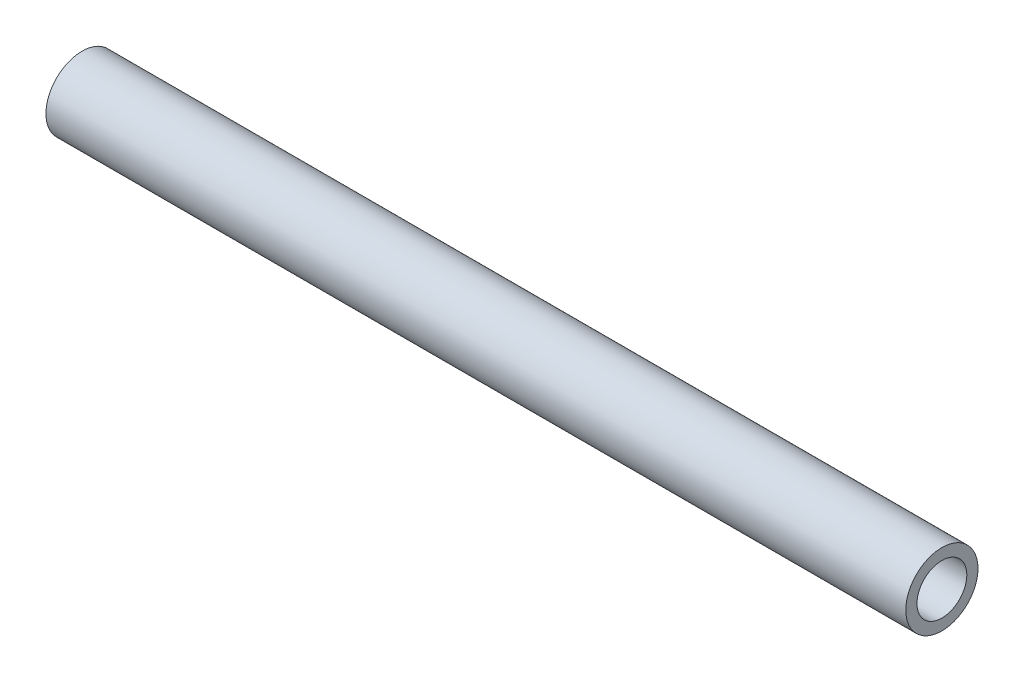
ISO-10303-21;
HEADER;
FILE_DESCRIPTION(('STEP AP214'),'2;1');
FILE_NAME('part.step','',(''),(''),'','','');
FILE_SCHEMA(('AUTOMOTIVE_DESIGN { 1 0 10303 214 1 1 1 1 }'));
ENDSEC;
DATA;
#1=APPLICATION_CONTEXT('core data for automotive mechanical design processes');
#2=APPLICATION_PROTOCOL_DEFINITION('international standard','automotive_design',2000,#1);
#3=PRODUCT_CONTEXT('',#1,'mechanical');
#4=PRODUCT('Part','Part','',(#3));
#5=PRODUCT_RELATED_PRODUCT_CATEGORY('part','',(#4));
#6=PRODUCT_DEFINITION_FORMATION('','',#4);
#7=PRODUCT_DEFINITION_CONTEXT('part definition',#1,'design');
#8=PRODUCT_DEFINITION('design','',#6,#7);
#9=PRODUCT_DEFINITION_SHAPE('','',#8);
#10=(LENGTH_UNIT() NAMED_UNIT(*) SI_UNIT(.MILLI.,.METRE.));
#11=(NAMED_UNIT(*) PLANE_ANGLE_UNIT() SI_UNIT($,.RADIAN.));
#12=(NAMED_UNIT(*) SI_UNIT($,.STERADIAN.) SOLID_ANGLE_UNIT());
#13=UNCERTAINTY_MEASURE_WITH_UNIT(LENGTH_MEASURE(1.E-05),#10,'distance_accuracy_value','');
#14=(GEOMETRIC_REPRESENTATION_CONTEXT(3) GLOBAL_UNCERTAINTY_ASSIGNED_CONTEXT((#13)) GLOBAL_UNIT_ASSIGNED_CONTEXT((#10,
#11,#12)) REPRESENTATION_CONTEXT('',''));
#15=CARTESIAN_POINT('',(0.,0.,0.));
#16=DIRECTION('',(0.,0.,1.));
#17=DIRECTION('',(1.,0.,0.));
#18=AXIS2_PLACEMENT_3D('',#15,#16,#17);
#19=CARTESIAN_POINT('',(-254.,0.,0.));
#20=DIRECTION('',(1.,0.,0.));
#21=DIRECTION('',(0.,0.,-1.));
#22=AXIS2_PLACEMENT_3D('',#19,#20,#21);
#23=CYLINDRICAL_SURFACE('',#22,10.668);
#24=CARTESIAN_POINT('',(-254.,0.,0.));
#25=DIRECTION('',(1.,0.,0.));
#26=DIRECTION('',(0.,0.,-1.));
#27=AXIS2_PLACEMENT_3D('',#24,#25,#26);
#28=CIRCLE('',#27,10.668);
#29=CARTESIAN_POINT('',(-254.,0.,-10.668));
#30=VERTEX_POINT('',#29);
#31=EDGE_CURVE('E10',#30,#30,#28,.T.);
#32=ORIENTED_EDGE('',*,*,#31,.T.);
#33=EDGE_LOOP('',(#32));
#34=FACE_BOUND('',#33,.T.);
#35=CARTESIAN_POINT('',(0.,0.,0.));
#36=DIRECTION('',(1.,0.,0.));
#37=DIRECTION('',(0.,0.,-1.));
#38=AXIS2_PLACEMENT_3D('',#35,#36,#37);
#39=CIRCLE('',#38,10.668);
#40=CARTESIAN_POINT('',(0.,0.,-10.668));
#41=VERTEX_POINT('',#40);
#42=EDGE_CURVE('E38',#41,#41,#39,.T.);
#43=ORIENTED_EDGE('',*,*,#42,.F.);
#44=EDGE_LOOP('',(#43));
#45=FACE_BOUND('',#44,.T.);
#46=ADVANCED_FACE('F35',(#34,#45),#23,.T.);
#47=CARTESIAN_POINT('',(-254.,0.,0.));
#48=DIRECTION('',(1.,0.,0.));
#49=DIRECTION('',(0.,0.,-1.));
#50=AXIS2_PLACEMENT_3D('',#47,#48,#49);
#51=PLANE('',#50);
#52=CARTESIAN_POINT('',(-254.,0.,0.));
#53=DIRECTION('',(1.,0.,0.));
#54=DIRECTION('',(0.,0.,-1.));
#55=AXIS2_PLACEMENT_3D('',#52,#53,#54);
#56=CIRCLE('',#55,7.366);
#57=CARTESIAN_POINT('',(-254.,0.,-7.366));
#58=VERTEX_POINT('',#57);
#59=EDGE_CURVE('E45',#58,#58,#56,.T.);
#60=ORIENTED_EDGE('',*,*,#59,.T.);
#61=EDGE_LOOP('',(#60));
#62=FACE_BOUND('',#61,.T.);
#63=ORIENTED_EDGE('',*,*,#31,.F.);
#64=EDGE_LOOP('',(#63));
#65=FACE_BOUND('',#64,.T.);
#66=ADVANCED_FACE('F53',(#62,#65),#51,.F.);
#67=CARTESIAN_POINT('',(0.,0.,0.));
#68=DIRECTION('',(1.,0.,0.));
#69=DIRECTION('',(0.,0.,-1.));
#70=AXIS2_PLACEMENT_3D('',#67,#68,#69);
#71=PLANE('',#70);
#72=CARTESIAN_POINT('',(0.,0.,0.));
#73=DIRECTION('',(1.,0.,0.));
#74=DIRECTION('',(0.,0.,-1.));
#75=AXIS2_PLACEMENT_3D('',#72,#73,#74);
#76=CIRCLE('',#75,7.366);
#77=CARTESIAN_POINT('',(0.,0.,-7.366));
#78=VERTEX_POINT('',#77);
#79=EDGE_CURVE('E47',#78,#78,#76,.T.);
#80=ORIENTED_EDGE('',*,*,#79,.F.);
#81=EDGE_LOOP('',(#80));
#82=FACE_BOUND('',#81,.T.);
#83=ORIENTED_EDGE('',*,*,#42,.T.);
#84=EDGE_LOOP('',(#83));
#85=FACE_BOUND('',#84,.T.);
#86=ADVANCED_FACE('F59',(#82,#85),#71,.T.);
#87=CARTESIAN_POINT('',(-254.,0.,0.));
#88=DIRECTION('',(1.,0.,0.));
#89=DIRECTION('',(0.,0.,-1.));
#90=AXIS2_PLACEMENT_3D('',#87,#88,#89);
#91=CYLINDRICAL_SURFACE('',#90,7.366);
#92=ORIENTED_EDGE('',*,*,#59,.F.);
#93=EDGE_LOOP('',(#92));
#94=FACE_BOUND('',#93,.T.);
#95=ORIENTED_EDGE('',*,*,#79,.T.);
#96=EDGE_LOOP('',(#95));
#97=FACE_BOUND('',#96,.T.);
#98=ADVANCED_FACE('F56',(#94,#97),#91,.F.);
#99=CLOSED_SHELL('',(#46,#66,#86,#98));
#100=MANIFOLD_SOLID_BREP('B2',#99);
#101=ADVANCED_BREP_SHAPE_REPRESENTATION('',(#18,#100),#14);
#102=SHAPE_DEFINITION_REPRESENTATION(#9,#101);
ENDSEC;
END-ISO-10303-21;
